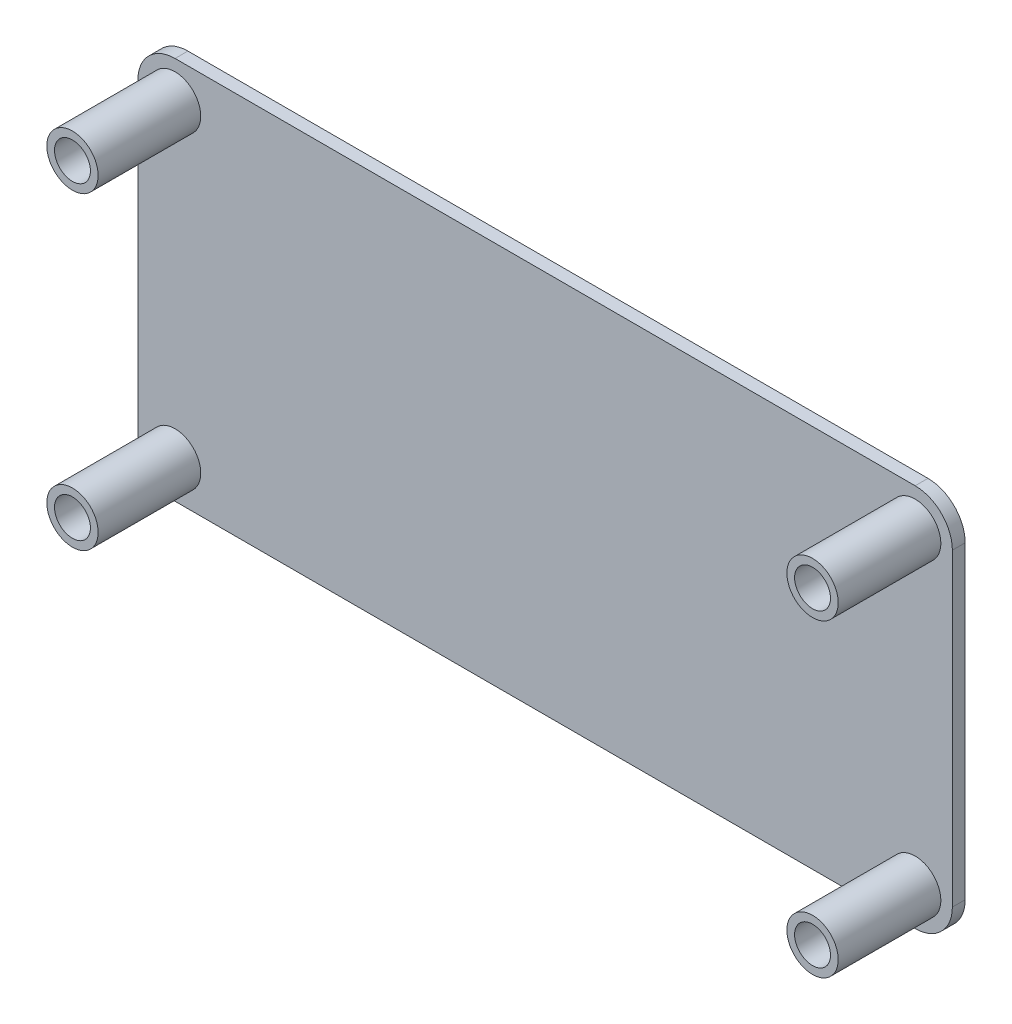
ISO-10303-21;
HEADER;
FILE_DESCRIPTION(('STEP AP214'),'2;1');
FILE_NAME('part.step','',(''),(''),'','','');
FILE_SCHEMA(('AUTOMOTIVE_DESIGN { 1 0 10303 214 1 1 1 1 }'));
ENDSEC;
DATA;
#1=APPLICATION_CONTEXT('core data for automotive mechanical design processes');
#2=APPLICATION_PROTOCOL_DEFINITION('international standard','automotive_design',2000,#1);
#3=PRODUCT_CONTEXT('',#1,'mechanical');
#4=PRODUCT('Part','Part','',(#3));
#5=PRODUCT_RELATED_PRODUCT_CATEGORY('part','',(#4));
#6=PRODUCT_DEFINITION_FORMATION('','',#4);
#7=PRODUCT_DEFINITION_CONTEXT('part definition',#1,'design');
#8=PRODUCT_DEFINITION('design','',#6,#7);
#9=PRODUCT_DEFINITION_SHAPE('','',#8);
#10=(LENGTH_UNIT() NAMED_UNIT(*) SI_UNIT(.MILLI.,.METRE.));
#11=(NAMED_UNIT(*) PLANE_ANGLE_UNIT() SI_UNIT($,.RADIAN.));
#12=(NAMED_UNIT(*) SI_UNIT($,.STERADIAN.) SOLID_ANGLE_UNIT());
#13=UNCERTAINTY_MEASURE_WITH_UNIT(LENGTH_MEASURE(1.E-05),#10,'distance_accuracy_value','');
#14=(GEOMETRIC_REPRESENTATION_CONTEXT(3) GLOBAL_UNCERTAINTY_ASSIGNED_CONTEXT((#13)) GLOBAL_UNIT_ASSIGNED_CONTEXT((#10,
#11,#12)) REPRESENTATION_CONTEXT('',''));
#15=CARTESIAN_POINT('',(0.,0.,0.));
#16=DIRECTION('',(0.,0.,1.));
#17=DIRECTION('',(1.,0.,0.));
#18=AXIS2_PLACEMENT_3D('',#15,#16,#17);
#19=CARTESIAN_POINT('',(0.,0.,1.));
#20=DIRECTION('',(0.,0.,-1.));
#21=DIRECTION('',(-1.,0.,0.));
#22=AXIS2_PLACEMENT_3D('',#19,#20,#21);
#23=CYLINDRICAL_SURFACE('',#22,2.9);
#24=CARTESIAN_POINT('',(0.,0.,0.));
#25=DIRECTION('',(0.,0.,1.));
#26=DIRECTION('',(-1.,0.,0.));
#27=AXIS2_PLACEMENT_3D('',#24,#25,#26);
#28=CIRCLE('',#27,2.9);
#29=CARTESIAN_POINT('',(-2.9,0.,0.));
#30=VERTEX_POINT('',#29);
#31=CARTESIAN_POINT('',(0.,-2.9,0.));
#32=VERTEX_POINT('',#31);
#33=EDGE_CURVE('E143',#30,#32,#28,.T.);
#34=ORIENTED_EDGE('',*,*,#33,.T.);
#35=DIRECTION('',(0.,0.,-1.));
#36=VECTOR('',#35,1.);
#37=CARTESIAN_POINT('',(0.,-2.9,1.));
#38=LINE('',#37,#36);
#39=CARTESIAN_POINT('',(0.,-2.9,1.));
#40=VERTEX_POINT('',#39);
#41=EDGE_CURVE('E42',#40,#32,#38,.T.);
#42=ORIENTED_EDGE('',*,*,#41,.F.);
#43=CARTESIAN_POINT('',(0.,0.,1.));
#44=DIRECTION('',(0.,0.,1.));
#45=DIRECTION('',(-1.,0.,0.));
#46=AXIS2_PLACEMENT_3D('',#43,#44,#45);
#47=CIRCLE('',#46,2.9);
#48=CARTESIAN_POINT('',(-2.9,0.,1.));
#49=VERTEX_POINT('',#48);
#50=EDGE_CURVE('E166',#49,#40,#47,.T.);
#51=ORIENTED_EDGE('',*,*,#50,.F.);
#52=DIRECTION('',(0.,0.,-1.));
#53=VECTOR('',#52,1.);
#54=CARTESIAN_POINT('',(-2.9,0.,1.));
#55=LINE('',#54,#53);
#56=EDGE_CURVE('E139',#49,#30,#55,.T.);
#57=ORIENTED_EDGE('',*,*,#56,.T.);
#58=EDGE_LOOP('',(#34,#42,#51,#57));
#59=FACE_BOUND('',#58,.T.);
#60=ADVANCED_FACE('F39',(#59),#23,.T.);
#61=CARTESIAN_POINT('',(0.,-2.9,1.));
#62=DIRECTION('',(0.,1.,0.));
#63=DIRECTION('',(0.,0.,1.));
#64=AXIS2_PLACEMENT_3D('',#61,#62,#63);
#65=PLANE('',#64);
#66=DIRECTION('',(1.,0.,0.));
#67=VECTOR('',#66,1.);
#68=CARTESIAN_POINT('',(0.,-2.9,0.));
#69=LINE('',#68,#67);
#70=CARTESIAN_POINT('',(57.7,-2.9,0.));
#71=VERTEX_POINT('',#70);
#72=EDGE_CURVE('E147',#32,#71,#69,.T.);
#73=ORIENTED_EDGE('',*,*,#72,.T.);
#74=DIRECTION('',(0.,0.,-1.));
#75=VECTOR('',#74,1.);
#76=CARTESIAN_POINT('',(57.7,-2.9,1.));
#77=LINE('',#76,#75);
#78=CARTESIAN_POINT('',(57.7,-2.9,1.));
#79=VERTEX_POINT('',#78);
#80=EDGE_CURVE('E180',#79,#71,#77,.T.);
#81=ORIENTED_EDGE('',*,*,#80,.F.);
#82=DIRECTION('',(1.,0.,0.));
#83=VECTOR('',#82,1.);
#84=CARTESIAN_POINT('',(0.,-2.9,1.));
#85=LINE('',#84,#83);
#86=EDGE_CURVE('E102',#40,#79,#85,.T.);
#87=ORIENTED_EDGE('',*,*,#86,.F.);
#88=ORIENTED_EDGE('',*,*,#41,.T.);
#89=EDGE_LOOP('',(#73,#81,#87,#88));
#90=FACE_BOUND('',#89,.T.);
#91=ADVANCED_FACE('F295',(#90),#65,.F.);
#92=CARTESIAN_POINT('',(57.7,0.,1.));
#93=DIRECTION('',(0.,0.,-1.));
#94=DIRECTION('',(-1.,0.,0.));
#95=AXIS2_PLACEMENT_3D('',#92,#93,#94);
#96=CYLINDRICAL_SURFACE('',#95,2.9);
#97=CARTESIAN_POINT('',(57.7,0.,0.));
#98=DIRECTION('',(0.,0.,1.));
#99=DIRECTION('',(1.,0.,0.));
#100=AXIS2_PLACEMENT_3D('',#97,#98,#99);
#101=CIRCLE('',#100,2.9);
#102=CARTESIAN_POINT('',(60.6,0.,0.));
#103=VERTEX_POINT('',#102);
#104=EDGE_CURVE('E151',#71,#103,#101,.T.);
#105=ORIENTED_EDGE('',*,*,#104,.T.);
#106=DIRECTION('',(0.,0.,-1.));
#107=VECTOR('',#106,1.);
#108=CARTESIAN_POINT('',(60.6,0.,1.));
#109=LINE('',#108,#107);
#110=CARTESIAN_POINT('',(60.6,0.,1.));
#111=VERTEX_POINT('',#110);
#112=EDGE_CURVE('E177',#111,#103,#109,.T.);
#113=ORIENTED_EDGE('',*,*,#112,.F.);
#114=CARTESIAN_POINT('',(57.7,0.,1.));
#115=DIRECTION('',(0.,0.,1.));
#116=DIRECTION('',(1.,0.,0.));
#117=AXIS2_PLACEMENT_3D('',#114,#115,#116);
#118=CIRCLE('',#117,2.9);
#119=EDGE_CURVE('E205',#79,#111,#118,.T.);
#120=ORIENTED_EDGE('',*,*,#119,.F.);
#121=ORIENTED_EDGE('',*,*,#80,.T.);
#122=EDGE_LOOP('',(#105,#113,#120,#121));
#123=FACE_BOUND('',#122,.T.);
#124=ADVANCED_FACE('F300',(#123),#96,.T.);
#125=CARTESIAN_POINT('',(60.6,0.,1.));
#126=DIRECTION('',(-1.,0.,0.));
#127=DIRECTION('',(0.,0.,1.));
#128=AXIS2_PLACEMENT_3D('',#125,#126,#127);
#129=PLANE('',#128);
#130=DIRECTION('',(0.,1.,0.));
#131=VECTOR('',#130,1.);
#132=CARTESIAN_POINT('',(60.6,0.,0.));
#133=LINE('',#132,#131);
#134=CARTESIAN_POINT('',(60.6,24.1,0.));
#135=VERTEX_POINT('',#134);
#136=EDGE_CURVE('E154',#103,#135,#133,.T.);
#137=ORIENTED_EDGE('',*,*,#136,.T.);
#138=DIRECTION('',(0.,0.,-1.));
#139=VECTOR('',#138,1.);
#140=CARTESIAN_POINT('',(60.6,24.1,1.));
#141=LINE('',#140,#139);
#142=CARTESIAN_POINT('',(60.6,24.1,1.));
#143=VERTEX_POINT('',#142);
#144=EDGE_CURVE('E173',#143,#135,#141,.T.);
#145=ORIENTED_EDGE('',*,*,#144,.F.);
#146=DIRECTION('',(0.,1.,0.));
#147=VECTOR('',#146,1.);
#148=CARTESIAN_POINT('',(60.6,0.,1.));
#149=LINE('',#148,#147);
#150=EDGE_CURVE('E208',#111,#143,#149,.T.);
#151=ORIENTED_EDGE('',*,*,#150,.F.);
#152=ORIENTED_EDGE('',*,*,#112,.T.);
#153=EDGE_LOOP('',(#137,#145,#151,#152));
#154=FACE_BOUND('',#153,.T.);
#155=ADVANCED_FACE('F309',(#154),#129,.F.);
#156=CARTESIAN_POINT('',(57.7,24.1,1.));
#157=DIRECTION('',(0.,0.,-1.));
#158=DIRECTION('',(-1.,0.,0.));
#159=AXIS2_PLACEMENT_3D('',#156,#157,#158);
#160=CYLINDRICAL_SURFACE('',#159,2.9);
#161=CARTESIAN_POINT('',(57.7,24.1,0.));
#162=DIRECTION('',(0.,0.,1.));
#163=DIRECTION('',(1.,0.,0.));
#164=AXIS2_PLACEMENT_3D('',#161,#162,#163);
#165=CIRCLE('',#164,2.9);
#166=CARTESIAN_POINT('',(57.6999999999999,27.,0.));
#167=VERTEX_POINT('',#166);
#168=EDGE_CURVE('E157',#135,#167,#165,.T.);
#169=ORIENTED_EDGE('',*,*,#168,.T.);
#170=DIRECTION('',(0.,0.,-1.));
#171=VECTOR('',#170,1.);
#172=CARTESIAN_POINT('',(57.6999999999999,27.,1.));
#173=LINE('',#172,#171);
#174=CARTESIAN_POINT('',(57.6999999999999,27.,1.));
#175=VERTEX_POINT('',#174);
#176=EDGE_CURVE('E132',#175,#167,#173,.T.);
#177=ORIENTED_EDGE('',*,*,#176,.F.);
#178=CARTESIAN_POINT('',(57.7,24.1,1.));
#179=DIRECTION('',(0.,0.,1.));
#180=DIRECTION('',(1.,0.,0.));
#181=AXIS2_PLACEMENT_3D('',#178,#179,#180);
#182=CIRCLE('',#181,2.9);
#183=EDGE_CURVE('E121',#143,#175,#182,.T.);
#184=ORIENTED_EDGE('',*,*,#183,.F.);
#185=ORIENTED_EDGE('',*,*,#144,.T.);
#186=EDGE_LOOP('',(#169,#177,#184,#185));
#187=FACE_BOUND('',#186,.T.);
#188=ADVANCED_FACE('F312',(#187),#160,.T.);
#189=CARTESIAN_POINT('',(0.,27.,1.));
#190=DIRECTION('',(0.,-1.,0.));
#191=DIRECTION('',(0.,0.,-1.));
#192=AXIS2_PLACEMENT_3D('',#189,#190,#191);
#193=PLANE('',#192);
#194=DIRECTION('',(-1.,0.,0.));
#195=VECTOR('',#194,1.);
#196=CARTESIAN_POINT('',(0.,27.,0.));
#197=LINE('',#196,#195);
#198=CARTESIAN_POINT('',(0.,27.,0.));
#199=VERTEX_POINT('',#198);
#200=EDGE_CURVE('E130',#167,#199,#197,.T.);
#201=ORIENTED_EDGE('',*,*,#200,.T.);
#202=DIRECTION('',(0.,0.,-1.));
#203=VECTOR('',#202,1.);
#204=CARTESIAN_POINT('',(0.,27.,1.));
#205=LINE('',#204,#203);
#206=CARTESIAN_POINT('',(0.,27.,1.));
#207=VERTEX_POINT('',#206);
#208=EDGE_CURVE('E127',#207,#199,#205,.T.);
#209=ORIENTED_EDGE('',*,*,#208,.F.);
#210=DIRECTION('',(-1.,0.,0.));
#211=VECTOR('',#210,1.);
#212=CARTESIAN_POINT('',(0.,27.,1.));
#213=LINE('',#212,#211);
#214=EDGE_CURVE('E115',#175,#207,#213,.T.);
#215=ORIENTED_EDGE('',*,*,#214,.F.);
#216=ORIENTED_EDGE('',*,*,#176,.T.);
#217=EDGE_LOOP('',(#201,#209,#215,#216));
#218=FACE_BOUND('',#217,.T.);
#219=ADVANCED_FACE('F128',(#218),#193,.F.);
#220=CARTESIAN_POINT('',(0.,24.1000000000001,1.));
#221=DIRECTION('',(0.,0.,-1.));
#222=DIRECTION('',(-1.,0.,0.));
#223=AXIS2_PLACEMENT_3D('',#220,#221,#222);
#224=CYLINDRICAL_SURFACE('',#223,2.89999999999992);
#225=CARTESIAN_POINT('',(0.,24.1000000000001,0.));
#226=DIRECTION('',(0.,0.,1.));
#227=DIRECTION('',(1.,0.,0.));
#228=AXIS2_PLACEMENT_3D('',#225,#226,#227);
#229=CIRCLE('',#228,2.89999999999992);
#230=CARTESIAN_POINT('',(-2.9,24.1,0.));
#231=VERTEX_POINT('',#230);
#232=EDGE_CURVE('E87',#199,#231,#229,.T.);
#233=ORIENTED_EDGE('',*,*,#232,.T.);
#234=DIRECTION('',(0.,0.,-1.));
#235=VECTOR('',#234,1.);
#236=CARTESIAN_POINT('',(-2.9,24.1,1.));
#237=LINE('',#236,#235);
#238=CARTESIAN_POINT('',(-2.9,24.1,1.));
#239=VERTEX_POINT('',#238);
#240=EDGE_CURVE('E133',#239,#231,#237,.T.);
#241=ORIENTED_EDGE('',*,*,#240,.F.);
#242=CARTESIAN_POINT('',(0.,24.1000000000001,1.));
#243=DIRECTION('',(0.,0.,1.));
#244=DIRECTION('',(1.,0.,0.));
#245=AXIS2_PLACEMENT_3D('',#242,#243,#244);
#246=CIRCLE('',#245,2.89999999999992);
#247=EDGE_CURVE('E119',#207,#239,#246,.T.);
#248=ORIENTED_EDGE('',*,*,#247,.F.);
#249=ORIENTED_EDGE('',*,*,#208,.T.);
#250=EDGE_LOOP('',(#233,#241,#248,#249));
#251=FACE_BOUND('',#250,.T.);
#252=ADVANCED_FACE('F135',(#251),#224,.T.);
#253=CARTESIAN_POINT('',(-2.9,0.,1.));
#254=DIRECTION('',(1.,0.,0.));
#255=DIRECTION('',(0.,0.,-1.));
#256=AXIS2_PLACEMENT_3D('',#253,#254,#255);
#257=PLANE('',#256);
#258=DIRECTION('',(0.,-1.,0.));
#259=VECTOR('',#258,1.);
#260=CARTESIAN_POINT('',(-2.9,0.,0.));
#261=LINE('',#260,#259);
#262=EDGE_CURVE('E93',#231,#30,#261,.T.);
#263=ORIENTED_EDGE('',*,*,#262,.T.);
#264=ORIENTED_EDGE('',*,*,#56,.F.);
#265=DIRECTION('',(0.,-1.,0.));
#266=VECTOR('',#265,1.);
#267=CARTESIAN_POINT('',(-2.9,0.,1.));
#268=LINE('',#267,#266);
#269=EDGE_CURVE('E58',#239,#49,#268,.T.);
#270=ORIENTED_EDGE('',*,*,#269,.F.);
#271=ORIENTED_EDGE('',*,*,#240,.T.);
#272=EDGE_LOOP('',(#263,#264,#270,#271));
#273=FACE_BOUND('',#272,.T.);
#274=ADVANCED_FACE('F268',(#273),#257,.F.);
#275=CARTESIAN_POINT('',(0.,0.,1.));
#276=DIRECTION('',(0.,0.,-1.));
#277=DIRECTION('',(-1.,0.,0.));
#278=AXIS2_PLACEMENT_3D('',#275,#276,#277);
#279=PLANE('',#278);
#280=CARTESIAN_POINT('',(57.6999999999999,24.1,0.999999999999999));
#281=DIRECTION('',(0.,0.,-1.));
#282=DIRECTION('',(-1.,0.,0.));
#283=AXIS2_PLACEMENT_3D('',#280,#281,#282);
#284=CIRCLE('',#283,2.);
#285=CARTESIAN_POINT('',(55.6999999999999,24.1,0.999999999999999));
#286=VERTEX_POINT('',#285);
#287=EDGE_CURVE('E11',#286,#286,#284,.F.);
#288=ORIENTED_EDGE('',*,*,#287,.F.);
#289=EDGE_LOOP('',(#288));
#290=FACE_BOUND('',#289,.T.);
#291=CARTESIAN_POINT('',(57.7,0.,0.999999999999999));
#292=DIRECTION('',(0.,0.,-1.));
#293=DIRECTION('',(-1.,0.,0.));
#294=AXIS2_PLACEMENT_3D('',#291,#292,#293);
#295=CIRCLE('',#294,2.);
#296=CARTESIAN_POINT('',(55.7,0.,0.999999999999999));
#297=VERTEX_POINT('',#296);
#298=EDGE_CURVE('E49',#297,#297,#295,.F.);
#299=ORIENTED_EDGE('',*,*,#298,.F.);
#300=EDGE_LOOP('',(#299));
#301=FACE_BOUND('',#300,.T.);
#302=CARTESIAN_POINT('',(0.,24.1,0.999999999999999));
#303=DIRECTION('',(0.,0.,-1.));
#304=DIRECTION('',(-1.,0.,0.));
#305=AXIS2_PLACEMENT_3D('',#302,#303,#304);
#306=CIRCLE('',#305,2.);
#307=CARTESIAN_POINT('',(-2.00000000000008,24.1,0.999999999999999));
#308=VERTEX_POINT('',#307);
#309=EDGE_CURVE('E191',#308,#308,#306,.F.);
#310=ORIENTED_EDGE('',*,*,#309,.F.);
#311=EDGE_LOOP('',(#310));
#312=FACE_BOUND('',#311,.T.);
#313=CARTESIAN_POINT('',(0.,0.,0.999999999999999));
#314=DIRECTION('',(0.,0.,-1.));
#315=DIRECTION('',(-1.,0.,0.));
#316=AXIS2_PLACEMENT_3D('',#313,#314,#315);
#317=CIRCLE('',#316,2.);
#318=CARTESIAN_POINT('',(-2.,0.,0.999999999999999));
#319=VERTEX_POINT('',#318);
#320=EDGE_CURVE('E187',#319,#319,#317,.F.);
#321=ORIENTED_EDGE('',*,*,#320,.F.);
#322=EDGE_LOOP('',(#321));
#323=FACE_BOUND('',#322,.T.);
#324=ORIENTED_EDGE('',*,*,#50,.T.);
#325=ORIENTED_EDGE('',*,*,#86,.T.);
#326=ORIENTED_EDGE('',*,*,#119,.T.);
#327=ORIENTED_EDGE('',*,*,#150,.T.);
#328=ORIENTED_EDGE('',*,*,#183,.T.);
#329=ORIENTED_EDGE('',*,*,#214,.T.);
#330=ORIENTED_EDGE('',*,*,#247,.T.);
#331=ORIENTED_EDGE('',*,*,#269,.T.);
#332=EDGE_LOOP('',(#324,#325,#326,#327,#328,#329,#330,#331));
#333=FACE_BOUND('',#332,.T.);
#334=ADVANCED_FACE('F117',(#290,#301,#312,#323,#333),#279,.F.);
#335=CARTESIAN_POINT('',(0.,0.,0.));
#336=DIRECTION('',(0.,0.,-1.));
#337=DIRECTION('',(-1.,0.,0.));
#338=AXIS2_PLACEMENT_3D('',#335,#336,#337);
#339=PLANE('',#338);
#340=ORIENTED_EDGE('',*,*,#33,.F.);
#341=ORIENTED_EDGE('',*,*,#262,.F.);
#342=ORIENTED_EDGE('',*,*,#232,.F.);
#343=ORIENTED_EDGE('',*,*,#200,.F.);
#344=ORIENTED_EDGE('',*,*,#168,.F.);
#345=ORIENTED_EDGE('',*,*,#136,.F.);
#346=ORIENTED_EDGE('',*,*,#104,.F.);
#347=ORIENTED_EDGE('',*,*,#72,.F.);
#348=EDGE_LOOP('',(#340,#341,#342,#343,#344,#345,#346,#347));
#349=FACE_BOUND('',#348,.T.);
#350=ADVANCED_FACE('F267',(#349),#339,.T.);
#351=CARTESIAN_POINT('',(0.,0.,9.));
#352=DIRECTION('',(0.,0.,-1.));
#353=DIRECTION('',(-1.,0.,0.));
#354=AXIS2_PLACEMENT_3D('',#351,#352,#353);
#355=CYLINDRICAL_SURFACE('',#354,2.);
#356=CARTESIAN_POINT('',(0.,0.,9.));
#357=DIRECTION('',(0.,0.,1.));
#358=DIRECTION('',(1.,0.,0.));
#359=AXIS2_PLACEMENT_3D('',#356,#357,#358);
#360=CIRCLE('',#359,2.);
#361=CARTESIAN_POINT('',(2.,0.,9.));
#362=VERTEX_POINT('',#361);
#363=EDGE_CURVE('E214',#362,#362,#360,.T.);
#364=ORIENTED_EDGE('',*,*,#363,.F.);
#365=EDGE_LOOP('',(#364));
#366=FACE_BOUND('',#365,.T.);
#367=ORIENTED_EDGE('',*,*,#320,.T.);
#368=EDGE_LOOP('',(#367));
#369=FACE_BOUND('',#368,.T.);
#370=ADVANCED_FACE('F372',(#366,#369),#355,.T.);
#371=CARTESIAN_POINT('',(0.,0.,9.));
#372=DIRECTION('',(0.,0.,-1.));
#373=DIRECTION('',(-1.,0.,0.));
#374=AXIS2_PLACEMENT_3D('',#371,#372,#373);
#375=CYLINDRICAL_SURFACE('',#374,1.4);
#376=CARTESIAN_POINT('',(0.,0.,9.));
#377=DIRECTION('',(0.,0.,1.));
#378=DIRECTION('',(1.,0.,0.));
#379=AXIS2_PLACEMENT_3D('',#376,#377,#378);
#380=CIRCLE('',#379,1.4);
#381=CARTESIAN_POINT('',(1.4,0.,9.));
#382=VERTEX_POINT('',#381);
#383=EDGE_CURVE('E217',#382,#382,#380,.T.);
#384=ORIENTED_EDGE('',*,*,#383,.T.);
#385=EDGE_LOOP('',(#384));
#386=FACE_BOUND('',#385,.T.);
#387=CARTESIAN_POINT('',(0.,0.,0.999999999999999));
#388=DIRECTION('',(0.,0.,-1.));
#389=DIRECTION('',(-1.,0.,0.));
#390=AXIS2_PLACEMENT_3D('',#387,#388,#389);
#391=CIRCLE('',#390,1.4);
#392=CARTESIAN_POINT('',(-1.4,0.,0.999999999999999));
#393=VERTEX_POINT('',#392);
#394=EDGE_CURVE('E148',#393,#393,#391,.F.);
#395=ORIENTED_EDGE('',*,*,#394,.F.);
#396=EDGE_LOOP('',(#395));
#397=FACE_BOUND('',#396,.T.);
#398=ADVANCED_FACE('F382',(#386,#397),#375,.F.);
#399=CARTESIAN_POINT('',(0.,0.,9.));
#400=DIRECTION('',(0.,0.,1.));
#401=DIRECTION('',(1.,0.,0.));
#402=AXIS2_PLACEMENT_3D('',#399,#400,#401);
#403=PLANE('',#402);
#404=ORIENTED_EDGE('',*,*,#363,.T.);
#405=EDGE_LOOP('',(#404));
#406=FACE_BOUND('',#405,.T.);
#407=ORIENTED_EDGE('',*,*,#383,.F.);
#408=EDGE_LOOP('',(#407));
#409=FACE_BOUND('',#408,.T.);
#410=ADVANCED_FACE('F288',(#406,#409),#403,.T.);
#411=ORIENTED_EDGE('',*,*,#394,.T.);
#412=EDGE_LOOP('',(#411));
#413=FACE_BOUND('',#412,.T.);
#414=ADVANCED_FACE('F272',(#413),#279,.F.);
#415=CARTESIAN_POINT('',(0.,24.1,9.));
#416=DIRECTION('',(0.,0.,-1.));
#417=DIRECTION('',(-1.,0.,0.));
#418=AXIS2_PLACEMENT_3D('',#415,#416,#417);
#419=CYLINDRICAL_SURFACE('',#418,2.);
#420=CARTESIAN_POINT('',(0.,24.1,9.));
#421=DIRECTION('',(0.,0.,1.));
#422=DIRECTION('',(1.,0.,0.));
#423=AXIS2_PLACEMENT_3D('',#420,#421,#422);
#424=CIRCLE('',#423,2.);
#425=CARTESIAN_POINT('',(1.99999999999992,24.1,9.));
#426=VERTEX_POINT('',#425);
#427=EDGE_CURVE('E224',#426,#426,#424,.T.);
#428=ORIENTED_EDGE('',*,*,#427,.F.);
#429=EDGE_LOOP('',(#428));
#430=FACE_BOUND('',#429,.T.);
#431=ORIENTED_EDGE('',*,*,#309,.T.);
#432=EDGE_LOOP('',(#431));
#433=FACE_BOUND('',#432,.T.);
#434=ADVANCED_FACE('F276',(#430,#433),#419,.T.);
#435=CARTESIAN_POINT('',(0.,24.1,9.));
#436=DIRECTION('',(0.,0.,-1.));
#437=DIRECTION('',(-1.,0.,0.));
#438=AXIS2_PLACEMENT_3D('',#435,#436,#437);
#439=CYLINDRICAL_SURFACE('',#438,1.4);
#440=CARTESIAN_POINT('',(0.,24.1,9.));
#441=DIRECTION('',(0.,0.,1.));
#442=DIRECTION('',(1.,0.,0.));
#443=AXIS2_PLACEMENT_3D('',#440,#441,#442);
#444=CIRCLE('',#443,1.4);
#445=CARTESIAN_POINT('',(1.39999999999992,24.1,9.));
#446=VERTEX_POINT('',#445);
#447=EDGE_CURVE('E228',#446,#446,#444,.T.);
#448=ORIENTED_EDGE('',*,*,#447,.T.);
#449=EDGE_LOOP('',(#448));
#450=FACE_BOUND('',#449,.T.);
#451=CARTESIAN_POINT('',(0.,24.1,0.999999999999999));
#452=DIRECTION('',(0.,0.,-1.));
#453=DIRECTION('',(-1.,0.,0.));
#454=AXIS2_PLACEMENT_3D('',#451,#452,#453);
#455=CIRCLE('',#454,1.4);
#456=CARTESIAN_POINT('',(-1.40000000000008,24.1,0.999999999999999));
#457=VERTEX_POINT('',#456);
#458=EDGE_CURVE('E220',#457,#457,#455,.F.);
#459=ORIENTED_EDGE('',*,*,#458,.F.);
#460=EDGE_LOOP('',(#459));
#461=FACE_BOUND('',#460,.T.);
#462=ADVANCED_FACE('F278',(#450,#461),#439,.F.);
#463=CARTESIAN_POINT('',(0.,24.1,9.));
#464=DIRECTION('',(0.,0.,1.));
#465=DIRECTION('',(1.,0.,0.));
#466=AXIS2_PLACEMENT_3D('',#463,#464,#465);
#467=PLANE('',#466);
#468=ORIENTED_EDGE('',*,*,#427,.T.);
#469=EDGE_LOOP('',(#468));
#470=FACE_BOUND('',#469,.T.);
#471=ORIENTED_EDGE('',*,*,#447,.F.);
#472=EDGE_LOOP('',(#471));
#473=FACE_BOUND('',#472,.T.);
#474=ADVANCED_FACE('F285',(#470,#473),#467,.T.);
#475=ORIENTED_EDGE('',*,*,#458,.T.);
#476=EDGE_LOOP('',(#475));
#477=FACE_BOUND('',#476,.T.);
#478=ADVANCED_FACE('F290',(#477),#279,.F.);
#479=CARTESIAN_POINT('',(57.7,0.,9.));
#480=DIRECTION('',(0.,0.,-1.));
#481=DIRECTION('',(-1.,0.,0.));
#482=AXIS2_PLACEMENT_3D('',#479,#480,#481);
#483=CYLINDRICAL_SURFACE('',#482,2.);
#484=CARTESIAN_POINT('',(57.7,0.,9.));
#485=DIRECTION('',(0.,0.,1.));
#486=DIRECTION('',(1.,0.,0.));
#487=AXIS2_PLACEMENT_3D('',#484,#485,#486);
#488=CIRCLE('',#487,2.);
#489=CARTESIAN_POINT('',(59.7,0.,9.));
#490=VERTEX_POINT('',#489);
#491=EDGE_CURVE('E236',#490,#490,#488,.T.);
#492=ORIENTED_EDGE('',*,*,#491,.F.);
#493=EDGE_LOOP('',(#492));
#494=FACE_BOUND('',#493,.T.);
#495=ORIENTED_EDGE('',*,*,#298,.T.);
#496=EDGE_LOOP('',(#495));
#497=FACE_BOUND('',#496,.T.);
#498=ADVANCED_FACE('F263',(#494,#497),#483,.T.);
#499=CARTESIAN_POINT('',(57.7,0.,9.));
#500=DIRECTION('',(0.,0.,-1.));
#501=DIRECTION('',(-1.,0.,0.));
#502=AXIS2_PLACEMENT_3D('',#499,#500,#501);
#503=CYLINDRICAL_SURFACE('',#502,1.4);
#504=CARTESIAN_POINT('',(57.7,0.,9.));
#505=DIRECTION('',(0.,0.,1.));
#506=DIRECTION('',(1.,0.,0.));
#507=AXIS2_PLACEMENT_3D('',#504,#505,#506);
#508=CIRCLE('',#507,1.4);
#509=CARTESIAN_POINT('',(59.1,0.,9.));
#510=VERTEX_POINT('',#509);
#511=EDGE_CURVE('E240',#510,#510,#508,.T.);
#512=ORIENTED_EDGE('',*,*,#511,.T.);
#513=EDGE_LOOP('',(#512));
#514=FACE_BOUND('',#513,.T.);
#515=CARTESIAN_POINT('',(57.7,0.,0.999999999999999));
#516=DIRECTION('',(0.,0.,-1.));
#517=DIRECTION('',(-1.,0.,0.));
#518=AXIS2_PLACEMENT_3D('',#515,#516,#517);
#519=CIRCLE('',#518,1.4);
#520=CARTESIAN_POINT('',(56.3,0.,0.999999999999999));
#521=VERTEX_POINT('',#520);
#522=EDGE_CURVE('E232',#521,#521,#519,.F.);
#523=ORIENTED_EDGE('',*,*,#522,.F.);
#524=EDGE_LOOP('',(#523));
#525=FACE_BOUND('',#524,.T.);
#526=ADVANCED_FACE('F443',(#514,#525),#503,.F.);
#527=CARTESIAN_POINT('',(57.7,0.,9.));
#528=DIRECTION('',(0.,0.,1.));
#529=DIRECTION('',(1.,0.,0.));
#530=AXIS2_PLACEMENT_3D('',#527,#528,#529);
#531=PLANE('',#530);
#532=ORIENTED_EDGE('',*,*,#491,.T.);
#533=EDGE_LOOP('',(#532));
#534=FACE_BOUND('',#533,.T.);
#535=ORIENTED_EDGE('',*,*,#511,.F.);
#536=EDGE_LOOP('',(#535));
#537=FACE_BOUND('',#536,.T.);
#538=ADVANCED_FACE('F453',(#534,#537),#531,.T.);
#539=ORIENTED_EDGE('',*,*,#522,.T.);
#540=EDGE_LOOP('',(#539));
#541=FACE_BOUND('',#540,.T.);
#542=ADVANCED_FACE('F435',(#541),#279,.F.);
#543=CARTESIAN_POINT('',(57.6999999999999,24.1,9.));
#544=DIRECTION('',(0.,0.,-1.));
#545=DIRECTION('',(-1.,0.,0.));
#546=AXIS2_PLACEMENT_3D('',#543,#544,#545);
#547=CYLINDRICAL_SURFACE('',#546,2.);
#548=CARTESIAN_POINT('',(57.6999999999999,24.1,9.));
#549=DIRECTION('',(0.,0.,1.));
#550=DIRECTION('',(1.,0.,0.));
#551=AXIS2_PLACEMENT_3D('',#548,#549,#550);
#552=CIRCLE('',#551,2.);
#553=CARTESIAN_POINT('',(59.6999999999999,24.1,9.));
#554=VERTEX_POINT('',#553);
#555=EDGE_CURVE('E248',#554,#554,#552,.T.);
#556=ORIENTED_EDGE('',*,*,#555,.F.);
#557=EDGE_LOOP('',(#556));
#558=FACE_BOUND('',#557,.T.);
#559=ORIENTED_EDGE('',*,*,#287,.T.);
#560=EDGE_LOOP('',(#559));
#561=FACE_BOUND('',#560,.T.);
#562=ADVANCED_FACE('F472',(#558,#561),#547,.T.);
#563=CARTESIAN_POINT('',(57.6999999999999,24.1,9.));
#564=DIRECTION('',(0.,0.,-1.));
#565=DIRECTION('',(-1.,0.,0.));
#566=AXIS2_PLACEMENT_3D('',#563,#564,#565);
#567=CYLINDRICAL_SURFACE('',#566,1.4);
#568=CARTESIAN_POINT('',(57.6999999999999,24.1,9.));
#569=DIRECTION('',(0.,0.,1.));
#570=DIRECTION('',(1.,0.,0.));
#571=AXIS2_PLACEMENT_3D('',#568,#569,#570);
#572=CIRCLE('',#571,1.4);
#573=CARTESIAN_POINT('',(59.0999999999999,24.1,9.));
#574=VERTEX_POINT('',#573);
#575=EDGE_CURVE('E252',#574,#574,#572,.T.);
#576=ORIENTED_EDGE('',*,*,#575,.T.);
#577=EDGE_LOOP('',(#576));
#578=FACE_BOUND('',#577,.T.);
#579=CARTESIAN_POINT('',(57.6999999999999,24.1,0.999999999999999));
#580=DIRECTION('',(0.,0.,-1.));
#581=DIRECTION('',(-1.,0.,0.));
#582=AXIS2_PLACEMENT_3D('',#579,#580,#581);
#583=CIRCLE('',#582,1.4);
#584=CARTESIAN_POINT('',(56.2999999999999,24.1,0.999999999999999));
#585=VERTEX_POINT('',#584);
#586=EDGE_CURVE('E244',#585,#585,#583,.F.);
#587=ORIENTED_EDGE('',*,*,#586,.F.);
#588=EDGE_LOOP('',(#587));
#589=FACE_BOUND('',#588,.T.);
#590=ADVANCED_FACE('F480',(#578,#589),#567,.F.);
#591=CARTESIAN_POINT('',(57.6999999999999,24.1,9.));
#592=DIRECTION('',(0.,0.,1.));
#593=DIRECTION('',(1.,0.,0.));
#594=AXIS2_PLACEMENT_3D('',#591,#592,#593);
#595=PLANE('',#594);
#596=ORIENTED_EDGE('',*,*,#555,.T.);
#597=EDGE_LOOP('',(#596));
#598=FACE_BOUND('',#597,.T.);
#599=ORIENTED_EDGE('',*,*,#575,.F.);
#600=EDGE_LOOP('',(#599));
#601=FACE_BOUND('',#600,.T.);
#602=ADVANCED_FACE('F490',(#598,#601),#595,.T.);
#603=ORIENTED_EDGE('',*,*,#586,.T.);
#604=EDGE_LOOP('',(#603));
#605=FACE_BOUND('',#604,.T.);
#606=ADVANCED_FACE('F271',(#605),#279,.F.);
#607=CLOSED_SHELL('',(#60,#91,#124,#155,#188,#219,#252,#274,#334,#350,#370,#398,#410,#414,#434,
#462,#474,#478,#498,#526,#538,#542,#562,#590,#602,#606));
#608=MANIFOLD_SOLID_BREP('B2',#607);
#609=ADVANCED_BREP_SHAPE_REPRESENTATION('',(#18,#608),#14);
#610=SHAPE_DEFINITION_REPRESENTATION(#9,#609);
ENDSEC;
END-ISO-10303-21;
